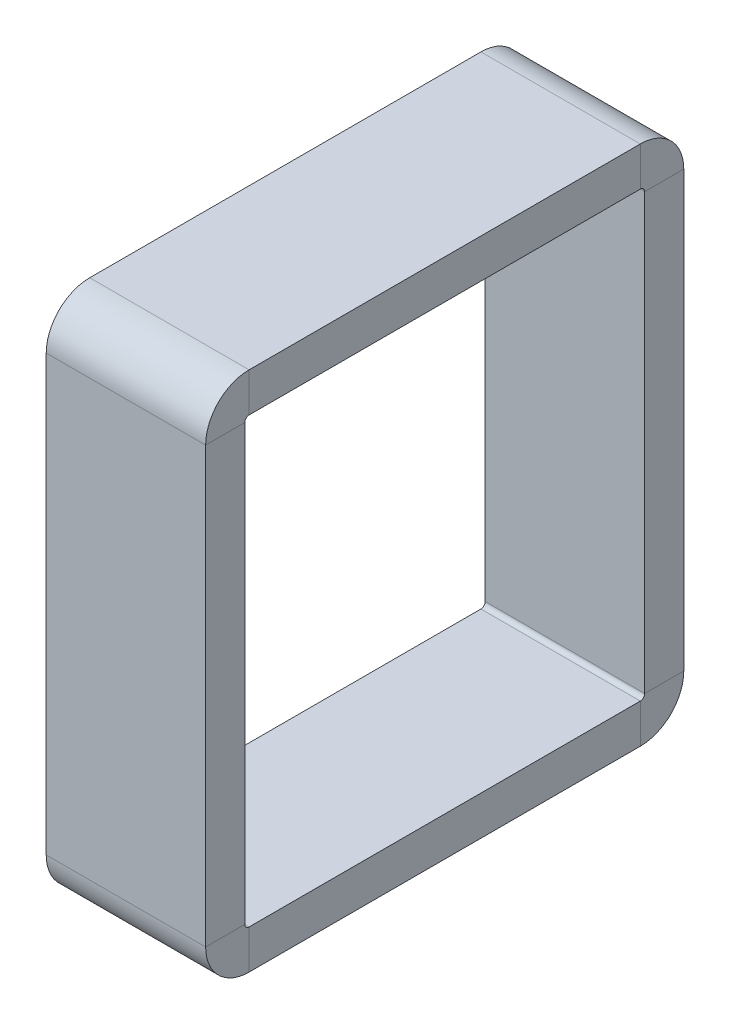
ISO-10303-21;
HEADER;
FILE_DESCRIPTION(('STEP AP214'),'2;1');
FILE_NAME('part.step','',(''),(''),'','','');
FILE_SCHEMA(('AUTOMOTIVE_DESIGN { 1 0 10303 214 1 1 1 1 }'));
ENDSEC;
DATA;
#1=APPLICATION_CONTEXT('core data for automotive mechanical design processes');
#2=APPLICATION_PROTOCOL_DEFINITION('international standard','automotive_design',2000,#1);
#3=PRODUCT_CONTEXT('',#1,'mechanical');
#4=PRODUCT('Part','Part','',(#3));
#5=PRODUCT_RELATED_PRODUCT_CATEGORY('part','',(#4));
#6=PRODUCT_DEFINITION_FORMATION('','',#4);
#7=PRODUCT_DEFINITION_CONTEXT('part definition',#1,'design');
#8=PRODUCT_DEFINITION('design','',#6,#7);
#9=PRODUCT_DEFINITION_SHAPE('','',#8);
#10=(LENGTH_UNIT() NAMED_UNIT(*) SI_UNIT(.MILLI.,.METRE.));
#11=(NAMED_UNIT(*) PLANE_ANGLE_UNIT() SI_UNIT($,.RADIAN.));
#12=(NAMED_UNIT(*) SI_UNIT($,.STERADIAN.) SOLID_ANGLE_UNIT());
#13=UNCERTAINTY_MEASURE_WITH_UNIT(LENGTH_MEASURE(1.E-05),#10,'distance_accuracy_value','');
#14=(GEOMETRIC_REPRESENTATION_CONTEXT(3) GLOBAL_UNCERTAINTY_ASSIGNED_CONTEXT((#13)) GLOBAL_UNIT_ASSIGNED_CONTEXT((#10,
#11,#12)) REPRESENTATION_CONTEXT('',''));
#15=CARTESIAN_POINT('',(0.,0.,0.));
#16=DIRECTION('',(0.,0.,1.));
#17=DIRECTION('',(1.,0.,0.));
#18=AXIS2_PLACEMENT_3D('',#15,#16,#17);
#19=CARTESIAN_POINT('',(3.71677795736341,0.754999569129981,-3.24612158699926));
#20=DIRECTION('',(-1.,1.74845553146952E-07,0.));
#21=DIRECTION('',(0.,-8.74227765734758E-08,-1.));
#22=AXIS2_PLACEMENT_3D('',#19,#20,#21);
#23=PLANE('',#22);
#24=CARTESIAN_POINT('',(3.71677795648918,0.749999568692863,-3.25112158656215));
#25=DIRECTION('',(0.999999999999985,-1.74845553146949E-07,0.));
#26=DIRECTION('',(-1.74845553146949E-07,-0.999999999999981,8.74190497768619E-08));
#27=AXIS2_PLACEMENT_3D('',#24,#25,#26);
#28=CIRCLE('',#27,0.00999999999999571);
#29=CARTESIAN_POINT('',(3.71677795474073,0.739999568692867,-3.25112158568792));
#30=VERTEX_POINT('',#29);
#31=CARTESIAN_POINT('',(3.71677795648918,0.749999567819639,-3.26112158656215));
#32=VERTEX_POINT('',#31);
#33=EDGE_CURVE('E11',#30,#32,#28,.T.);
#34=ORIENTED_EDGE('',*,*,#33,.F.);
#35=DIRECTION('',(1.74845555319994E-07,0.999999999999981,-8.74227801271592E-08));
#36=VECTOR('',#35,1.);
#37=CARTESIAN_POINT('',(3.71677793900463,0.649999568693867,-3.25112157782087));
#38=LINE('',#37,#36);
#39=CARTESIAN_POINT('',(3.71677793900463,0.649999568693867,-3.25112157781987));
#40=VERTEX_POINT('',#39);
#41=EDGE_CURVE('E295',#40,#30,#38,.T.);
#42=ORIENTED_EDGE('',*,*,#41,.F.);
#43=CARTESIAN_POINT('',(3.71677795648918,0.749999568693535,-3.25112158656248));
#44=DIRECTION('',(-0.999999999999985,1.74845553146949E-07,0.));
#45=DIRECTION('',(0.,-8.74290018163109E-08,-0.999999999999996));
#46=AXIS2_PLACEMENT_3D('',#43,#44,#45);
#47=CIRCLE('',#46,0.0999999999996649);
#48=CARTESIAN_POINT('',(3.71677795648918,0.749999559951589,-3.35112158656215));
#49=VERTEX_POINT('',#48);
#50=EDGE_CURVE('E292',#49,#40,#47,.T.);
#51=ORIENTED_EDGE('',*,*,#50,.F.);
#52=DIRECTION('',(0.,-8.74227825933516E-08,-0.999999999999996));
#53=VECTOR('',#52,1.);
#54=CARTESIAN_POINT('',(3.71677795648918,0.749999567818639,-3.26112158656215));
#55=LINE('',#54,#53);
#56=EDGE_CURVE('E281',#32,#49,#55,.T.);
#57=ORIENTED_EDGE('',*,*,#56,.F.);
#58=EDGE_LOOP('',(#34,#42,#51,#57));
#59=FACE_BOUND('',#58,.T.);
#60=ADVANCED_FACE('F17',(#59),#23,.F.);
#61=CARTESIAN_POINT('',(3.35000013200841,0.754999633259452,-3.24612158699926));
#62=DIRECTION('',(-1.,1.74845553146952E-07,0.));
#63=DIRECTION('',(0.,-8.74227765734758E-08,-1.));
#64=AXIS2_PLACEMENT_3D('',#61,#62,#63);
#65=PLANE('',#64);
#66=DIRECTION('',(0.,-8.74227764254459E-08,-0.999999999999996));
#67=VECTOR('',#66,1.);
#68=CARTESIAN_POINT('',(3.35000013113418,0.749999631948111,-3.26112158656215));
#69=LINE('',#68,#67);
#70=CARTESIAN_POINT('',(3.35000013113418,0.749999631949111,-3.26112158656215));
#71=VERTEX_POINT('',#70);
#72=CARTESIAN_POINT('',(3.35000013113418,0.749999624081061,-3.35112158656215));
#73=VERTEX_POINT('',#72);
#74=EDGE_CURVE('E24',#71,#73,#69,.T.);
#75=ORIENTED_EDGE('',*,*,#74,.T.);
#76=CARTESIAN_POINT('',(3.35000013113418,0.749999632823002,-3.25112158656249));
#77=DIRECTION('',(-0.999999999999985,1.74845553146949E-07,0.));
#78=DIRECTION('',(0.,-8.7429410378384E-08,-0.999999999999996));
#79=AXIS2_PLACEMENT_3D('',#76,#77,#78);
#80=CIRCLE('',#79,0.0999999999996649);
#81=CARTESIAN_POINT('',(3.35000011364963,0.649999632822338,-3.25112157781987));
#82=VERTEX_POINT('',#81);
#83=EDGE_CURVE('E290',#73,#82,#80,.T.);
#84=ORIENTED_EDGE('',*,*,#83,.T.);
#85=DIRECTION('',(-1.74845555319994E-07,-0.999999999999981,8.74227801271592E-08));
#86=VECTOR('',#85,1.);
#87=CARTESIAN_POINT('',(3.35000012938573,0.739999632822338,-3.25112158568892));
#88=LINE('',#87,#86);
#89=CARTESIAN_POINT('',(3.35000012938573,0.739999632822338,-3.25112158568792));
#90=VERTEX_POINT('',#89);
#91=EDGE_CURVE('E284',#90,#82,#88,.T.);
#92=ORIENTED_EDGE('',*,*,#91,.F.);
#93=CARTESIAN_POINT('',(3.35000013113418,0.749999632822289,-3.2511215865622));
#94=DIRECTION('',(0.999999999999985,-1.74845553146949E-07,0.));
#95=DIRECTION('',(-1.74845553146949E-07,-0.999999999999981,8.7427665107533E-08));
#96=AXIS2_PLACEMENT_3D('',#93,#94,#95);
#97=CIRCLE('',#96,0.00999999999999571);
#98=EDGE_CURVE('E274',#90,#71,#97,.T.);
#99=ORIENTED_EDGE('',*,*,#98,.T.);
#100=EDGE_LOOP('',(#75,#84,#92,#99));
#101=FACE_BOUND('',#100,.T.);
#102=ADVANCED_FACE('F409',(#101),#65,.T.);
#103=CARTESIAN_POINT('',(3.71677795648918,0.749999568693535,-3.25112158656248));
#104=DIRECTION('',(-1.,1.74845540855596E-07,0.));
#105=DIRECTION('',(-1.74845540855597E-07,-1.,8.74227765734759E-08));
#106=AXIS2_PLACEMENT_3D('',#103,#104,#105);
#107=CYLINDRICAL_SURFACE('',#106,0.0999999999996679);
#108=ORIENTED_EDGE('',*,*,#50,.T.);
#109=DIRECTION('',(0.999999999999985,-1.74845553083486E-07,0.));
#110=VECTOR('',#109,1.);
#111=CARTESIAN_POINT('',(3.35000011364963,0.649999632823338,-3.25112157782087));
#112=LINE('',#111,#110);
#113=EDGE_CURVE('E287',#82,#40,#112,.T.);
#114=ORIENTED_EDGE('',*,*,#113,.F.);
#115=ORIENTED_EDGE('',*,*,#83,.F.);
#116=DIRECTION('',(-0.999999999999985,1.74845553083486E-07,0.));
#117=VECTOR('',#116,1.);
#118=CARTESIAN_POINT('',(3.71677795648918,0.749999559950589,-3.35112158656215));
#119=LINE('',#118,#117);
#120=EDGE_CURVE('E268',#49,#73,#119,.T.);
#121=ORIENTED_EDGE('',*,*,#120,.F.);
#122=EDGE_LOOP('',(#108,#114,#115,#121));
#123=FACE_BOUND('',#122,.T.);
#124=ADVANCED_FACE('F345',(#123),#107,.T.);
#125=CARTESIAN_POINT('',(3.71677795648918,0.749999568692863,-3.25112158656215));
#126=DIRECTION('',(1.,-1.74845430233397E-07,1.30556275034351E-13));
#127=DIRECTION('',(-1.74845430233408E-07,-1.,8.74227765734759E-08));
#128=AXIS2_PLACEMENT_3D('',#125,#126,#127);
#129=CYLINDRICAL_SURFACE('',#128,0.00999999999999601);
#130=ORIENTED_EDGE('',*,*,#33,.T.);
#131=DIRECTION('',(-0.999999999999985,1.74844189739206E-07,0.));
#132=VECTOR('',#131,1.);
#133=CARTESIAN_POINT('',(3.71677795648918,0.749999567818889,-3.26112158656215));
#134=LINE('',#133,#132);
#135=EDGE_CURVE('E276',#32,#71,#134,.T.);
#136=ORIENTED_EDGE('',*,*,#135,.T.);
#137=ORIENTED_EDGE('',*,*,#98,.F.);
#138=DIRECTION('',(-0.999999999999985,1.74845553083486E-07,0.));
#139=VECTOR('',#138,1.);
#140=CARTESIAN_POINT('',(3.71677795474073,0.739999568692867,-3.25112158568892));
#141=LINE('',#140,#139);
#142=EDGE_CURVE('E262',#30,#90,#141,.T.);
#143=ORIENTED_EDGE('',*,*,#142,.F.);
#144=EDGE_LOOP('',(#130,#136,#137,#143));
#145=FACE_BOUND('',#144,.T.);
#146=ADVANCED_FACE('F304',(#145),#129,.F.);
#147=CARTESIAN_POINT('',(3.71677793900464,0.649999647374366,-2.35112157782087));
#148=DIRECTION('',(-1.,1.74845553146952E-07,0.));
#149=DIRECTION('',(1.74845553146952E-07,1.,-8.74227765734759E-08));
#150=AXIS2_PLACEMENT_3D('',#147,#148,#149);
#151=PLANE('',#150);
#152=DIRECTION('',(0.,-8.7422776548804E-08,-0.999999999999996));
#153=VECTOR('',#152,1.);
#154=CARTESIAN_POINT('',(3.71677793900464,0.649999647374366,-2.35112157782087));
#155=LINE('',#154,#153);
#156=CARTESIAN_POINT('',(3.71677793900364,0.649999647377366,-2.35112157781787));
#157=VERTEX_POINT('',#156);
#158=EDGE_CURVE('E278',#157,#40,#155,.T.);
#159=ORIENTED_EDGE('',*,*,#158,.T.);
#160=ORIENTED_EDGE('',*,*,#41,.T.);
#161=DIRECTION('',(0.,-8.74227765488039E-08,-0.999999999999996));
#162=VECTOR('',#161,1.);
#163=CARTESIAN_POINT('',(3.71677795474074,0.739999647373366,-2.35112158568892));
#164=LINE('',#163,#162);
#165=CARTESIAN_POINT('',(3.71677795473974,0.739999647376365,-2.35112158568592));
#166=VERTEX_POINT('',#165);
#167=EDGE_CURVE('E265',#166,#30,#164,.T.);
#168=ORIENTED_EDGE('',*,*,#167,.F.);
#169=DIRECTION('',(1.74845550387524E-07,0.999999999999981,-8.74121663959712E-08));
#170=VECTOR('',#169,1.);
#171=CARTESIAN_POINT('',(3.71677793900364,0.649999647375321,-2.35112157782182));
#172=LINE('',#171,#170);
#173=EDGE_CURVE('E147',#157,#166,#172,.T.);
#174=ORIENTED_EDGE('',*,*,#173,.F.);
#175=EDGE_LOOP('',(#159,#160,#168,#174));
#176=FACE_BOUND('',#175,.T.);
#177=ADVANCED_FACE('F297',(#176),#151,.F.);
#178=CARTESIAN_POINT('',(3.35000011364964,0.649999711503837,-2.35112157782087));
#179=DIRECTION('',(1.74845553146952E-07,1.,-8.74227765734759E-08));
#180=DIRECTION('',(1.,-1.74845553146952E-07,0.));
#181=AXIS2_PLACEMENT_3D('',#178,#179,#180);
#182=PLANE('',#181);
#183=DIRECTION('',(0.,-8.7422776548804E-08,-0.999999999999996));
#184=VECTOR('',#183,1.);
#185=CARTESIAN_POINT('',(3.35000011364964,0.649999711503837,-2.35112157782087));
#186=LINE('',#185,#184);
#187=CARTESIAN_POINT('',(3.35000011365064,0.649999711506837,-2.35112157781787));
#188=VERTEX_POINT('',#187);
#189=EDGE_CURVE('E271',#188,#82,#186,.T.);
#190=ORIENTED_EDGE('',*,*,#189,.T.);
#191=ORIENTED_EDGE('',*,*,#113,.T.);
#192=ORIENTED_EDGE('',*,*,#158,.F.);
#193=DIRECTION('',(0.999999999999985,-1.74845553083486E-07,0.));
#194=VECTOR('',#193,1.);
#195=CARTESIAN_POINT('',(3.35000011364964,0.649999711503837,-2.35112157782087));
#196=LINE('',#195,#194);
#197=EDGE_CURVE('E255',#188,#157,#196,.T.);
#198=ORIENTED_EDGE('',*,*,#197,.F.);
#199=EDGE_LOOP('',(#190,#191,#192,#198));
#200=FACE_BOUND('',#199,.T.);
#201=ADVANCED_FACE('F342',(#200),#182,.F.);
#202=CARTESIAN_POINT('',(3.71677795474074,0.739999647373366,-2.35112158568892));
#203=DIRECTION('',(-1.74845553146952E-07,-1.,8.74227765734759E-08));
#204=DIRECTION('',(-1.,1.74845553146952E-07,0.));
#205=AXIS2_PLACEMENT_3D('',#202,#203,#204);
#206=PLANE('',#205);
#207=ORIENTED_EDGE('',*,*,#167,.T.);
#208=ORIENTED_EDGE('',*,*,#142,.T.);
#209=DIRECTION('',(0.,-8.74227765488039E-08,-0.999999999999996));
#210=VECTOR('',#209,1.);
#211=CARTESIAN_POINT('',(3.35000012938574,0.739999711502837,-2.35112158568892));
#212=LINE('',#211,#210);
#213=CARTESIAN_POINT('',(3.35000012938674,0.739999711505837,-2.35112158568592));
#214=VERTEX_POINT('',#213);
#215=EDGE_CURVE('E259',#214,#90,#212,.T.);
#216=ORIENTED_EDGE('',*,*,#215,.F.);
#217=DIRECTION('',(-0.999999999999985,1.74845553083486E-07,0.));
#218=VECTOR('',#217,1.);
#219=CARTESIAN_POINT('',(3.71677795474074,0.739999647373366,-2.35112158568892));
#220=LINE('',#219,#218);
#221=EDGE_CURVE('E251',#166,#214,#220,.T.);
#222=ORIENTED_EDGE('',*,*,#221,.F.);
#223=EDGE_LOOP('',(#207,#208,#216,#222));
#224=FACE_BOUND('',#223,.T.);
#225=ADVANCED_FACE('F301',(#224),#206,.F.);
#226=CARTESIAN_POINT('',(3.35000012938574,0.739999711502837,-2.35112158568892));
#227=DIRECTION('',(1.,-1.74845553146952E-07,0.));
#228=DIRECTION('',(-1.74845553146952E-07,-1.,8.74227765734759E-08));
#229=AXIS2_PLACEMENT_3D('',#226,#227,#228);
#230=PLANE('',#229);
#231=ORIENTED_EDGE('',*,*,#215,.T.);
#232=ORIENTED_EDGE('',*,*,#91,.T.);
#233=ORIENTED_EDGE('',*,*,#189,.F.);
#234=DIRECTION('',(-1.7484555038515E-07,-0.999999999999981,8.74231995444866E-08));
#235=VECTOR('',#234,1.);
#236=CARTESIAN_POINT('',(3.35000012938674,0.739999711503105,-2.35112158568896));
#237=LINE('',#236,#235);
#238=EDGE_CURVE('E242',#214,#188,#237,.T.);
#239=ORIENTED_EDGE('',*,*,#238,.F.);
#240=EDGE_LOOP('',(#231,#232,#233,#239));
#241=FACE_BOUND('',#240,.T.);
#242=ADVANCED_FACE('F308',(#241),#230,.F.);
#243=CARTESIAN_POINT('',(3.71677814007701,1.79999955557945,-3.40112167835706));
#244=DIRECTION('',(1.,-1.74845553146952E-07,0.));
#245=DIRECTION('',(0.,8.74227765734759E-08,1.));
#246=AXIS2_PLACEMENT_3D('',#243,#244,#245);
#247=PLANE('',#246);
#248=ORIENTED_EDGE('',*,*,#56,.T.);
#249=DIRECTION('',(1.74845553146948E-07,0.999999999999981,-8.74247767512754E-08));
#250=VECTOR('',#249,1.);
#251=CARTESIAN_POINT('',(3.71677795648918,0.749999559950589,-3.35112158656215));
#252=LINE('',#251,#250);
#253=CARTESIAN_POINT('',(3.71677813133474,1.74999955994959,-3.35112167398592));
#254=VERTEX_POINT('',#253);
#255=EDGE_CURVE('E253',#49,#254,#252,.T.);
#256=ORIENTED_EDGE('',*,*,#255,.T.);
#257=DIRECTION('',(0.,8.74338872897881E-08,0.999999999999996));
#258=VECTOR('',#257,1.);
#259=CARTESIAN_POINT('',(3.71677813133474,1.74999955995059,-3.35112167398692));
#260=LINE('',#259,#258);
#261=CARTESIAN_POINT('',(3.71677813133374,1.74999956781864,-3.26112167398592));
#262=VERTEX_POINT('',#261);
#263=EDGE_CURVE('E245',#254,#262,#260,.T.);
#264=ORIENTED_EDGE('',*,*,#263,.T.);
#265=DIRECTION('',(-1.74845553146774E-07,-0.999999999999981,8.74237762181981E-08));
#266=VECTOR('',#265,1.);
#267=CARTESIAN_POINT('',(3.71677813133474,1.74999956781964,-3.26112167398592));
#268=LINE('',#267,#266);
#269=EDGE_CURVE('E233',#262,#32,#268,.T.);
#270=ORIENTED_EDGE('',*,*,#269,.T.);
#271=EDGE_LOOP('',(#248,#256,#264,#270));
#272=FACE_BOUND('',#271,.T.);
#273=ADVANCED_FACE('F350',(#272),#247,.T.);
#274=CARTESIAN_POINT('',(3.71677795648918,0.749999559950589,-3.35112158656215));
#275=DIRECTION('',(0.,8.7424776751277E-08,1.));
#276=DIRECTION('',(1.74845553146952E-07,1.,-8.7424776751277E-08));
#277=AXIS2_PLACEMENT_3D('',#274,#275,#276);
#278=PLANE('',#277);
#279=ORIENTED_EDGE('',*,*,#120,.T.);
#280=DIRECTION('',(1.74845553146948E-07,0.999999999999981,-8.74247767512754E-08));
#281=VECTOR('',#280,1.);
#282=CARTESIAN_POINT('',(3.35000013113418,0.749999624080061,-3.35112158656215));
#283=LINE('',#282,#281);
#284=CARTESIAN_POINT('',(3.35000030598074,1.74999962407906,-3.35112167398593));
#285=VERTEX_POINT('',#284);
#286=EDGE_CURVE('E247',#73,#285,#283,.T.);
#287=ORIENTED_EDGE('',*,*,#286,.T.);
#288=DIRECTION('',(-0.999999999999985,1.74845553083486E-07,0.));
#289=VECTOR('',#288,1.);
#290=CARTESIAN_POINT('',(3.71677813133474,1.74999955995059,-3.35112167398692));
#291=LINE('',#290,#289);
#292=EDGE_CURVE('E236',#254,#285,#291,.T.);
#293=ORIENTED_EDGE('',*,*,#292,.F.);
#294=ORIENTED_EDGE('',*,*,#255,.F.);
#295=EDGE_LOOP('',(#279,#287,#293,#294));
#296=FACE_BOUND('',#295,.T.);
#297=ADVANCED_FACE('F364',(#296),#278,.F.);
#298=CARTESIAN_POINT('',(3.71677813133474,1.74999956781964,-3.26112167398592));
#299=DIRECTION('',(0.,-8.74237762182872E-08,-1.));
#300=DIRECTION('',(-1.74845553146952E-07,-1.,8.74237762182872E-08));
#301=AXIS2_PLACEMENT_3D('',#298,#299,#300);
#302=PLANE('',#301);
#303=DIRECTION('',(-0.999999999999985,1.74844189739206E-07,0.));
#304=VECTOR('',#303,1.);
#305=CARTESIAN_POINT('',(3.71677813133474,1.74999956781939,-3.26112167398592));
#306=LINE('',#305,#304);
#307=CARTESIAN_POINT('',(3.35000030598074,1.74999963194711,-3.26112167398593));
#308=VERTEX_POINT('',#307);
#309=EDGE_CURVE('E249',#262,#308,#306,.T.);
#310=ORIENTED_EDGE('',*,*,#309,.T.);
#311=DIRECTION('',(-1.74845553146861E-07,-0.999999999999981,8.74237762182418E-08));
#312=VECTOR('',#311,1.);
#313=CARTESIAN_POINT('',(3.35000030597974,1.74999963194836,-3.26112167398593));
#314=LINE('',#313,#312);
#315=EDGE_CURVE('E239',#308,#71,#314,.T.);
#316=ORIENTED_EDGE('',*,*,#315,.T.);
#317=ORIENTED_EDGE('',*,*,#135,.F.);
#318=ORIENTED_EDGE('',*,*,#269,.F.);
#319=EDGE_LOOP('',(#310,#316,#317,#318));
#320=FACE_BOUND('',#319,.T.);
#321=ADVANCED_FACE('F355',(#320),#302,.F.);
#322=CARTESIAN_POINT('',(3.35000031472201,1.79999961970892,-3.40112167835707));
#323=DIRECTION('',(1.,-1.74845553146952E-07,0.));
#324=DIRECTION('',(0.,8.74227765734759E-08,1.));
#325=AXIS2_PLACEMENT_3D('',#322,#323,#324);
#326=PLANE('',#325);
#327=ORIENTED_EDGE('',*,*,#315,.F.);
#328=DIRECTION('',(0.,8.74333864567739E-08,0.999999999999996));
#329=VECTOR('',#328,1.);
#330=CARTESIAN_POINT('',(3.35000030597974,1.74999962407911,-3.35112167398597));
#331=LINE('',#330,#329);
#332=EDGE_CURVE('E228',#285,#308,#331,.T.);
#333=ORIENTED_EDGE('',*,*,#332,.F.);
#334=ORIENTED_EDGE('',*,*,#286,.F.);
#335=ORIENTED_EDGE('',*,*,#74,.F.);
#336=EDGE_LOOP('',(#327,#333,#334,#335));
#337=FACE_BOUND('',#336,.T.);
#338=ADVANCED_FACE('F361',(#337),#326,.F.);
#339=CARTESIAN_POINT('',(3.71677814969352,1.85499956912898,-3.24612168316632));
#340=DIRECTION('',(-1.,1.74845553146952E-07,0.));
#341=DIRECTION('',(0.,-8.74227765734759E-08,-1.));
#342=AXIS2_PLACEMENT_3D('',#339,#340,#341);
#343=PLANE('',#342);
#344=CARTESIAN_POINT('',(3.71677813133474,1.74999956869287,-3.25112167398593));
#345=DIRECTION('',(0.999999999999985,-1.74845553146949E-07,0.));
#346=DIRECTION('',(0.,-8.74249561633335E-08,-0.999999999999996));
#347=AXIS2_PLACEMENT_3D('',#344,#345,#346);
#348=CIRCLE('',#347,0.0099999999999977);
#349=CARTESIAN_POINT('',(3.71677813308219,1.75999956869287,-3.25112167486015));
#350=VERTEX_POINT('',#349);
#351=EDGE_CURVE('E231',#262,#350,#348,.T.);
#352=ORIENTED_EDGE('',*,*,#351,.F.);
#353=ORIENTED_EDGE('',*,*,#263,.F.);
#354=CARTESIAN_POINT('',(3.71677813133474,1.74999956869307,-3.25112167398713));
#355=DIRECTION('',(-0.999999999999985,1.74845553146949E-07,0.));
#356=DIRECTION('',(1.74845553146949E-07,0.999999999999981,-8.74205197131637E-08));
#357=AXIS2_PLACEMENT_3D('',#354,#355,#356);
#358=CIRCLE('',#357,0.099999999998794);
#359=CARTESIAN_POINT('',(3.71677814881829,1.84999956869187,-3.2511216827282));
#360=VERTEX_POINT('',#359);
#361=EDGE_CURVE('E225',#360,#254,#358,.T.);
#362=ORIENTED_EDGE('',*,*,#361,.F.);
#363=DIRECTION('',(1.74845555319994E-07,0.999999999999981,-8.74338823574056E-08));
#364=VECTOR('',#363,1.);
#365=CARTESIAN_POINT('',(3.71677813308319,1.75999956869287,-3.25112167486015));
#366=LINE('',#365,#364);
#367=EDGE_CURVE('E215',#350,#360,#366,.T.);
#368=ORIENTED_EDGE('',*,*,#367,.F.);
#369=EDGE_LOOP('',(#352,#353,#362,#368));
#370=FACE_BOUND('',#369,.T.);
#371=ADVANCED_FACE('F372',(#370),#343,.F.);
#372=CARTESIAN_POINT('',(3.71677813133474,1.74999956869307,-3.25112167398713));
#373=DIRECTION('',(-1.,1.74845565438305E-07,0.));
#374=DIRECTION('',(-1.74845565438306E-07,-1.,8.74227765734759E-08));
#375=AXIS2_PLACEMENT_3D('',#372,#373,#374);
#376=CYLINDRICAL_SURFACE('',#375,0.0999999999987971);
#377=ORIENTED_EDGE('',*,*,#361,.T.);
#378=ORIENTED_EDGE('',*,*,#292,.T.);
#379=CARTESIAN_POINT('',(3.35000030597974,1.74999963282255,-3.25112167398713));
#380=DIRECTION('',(-0.999999999999985,1.74845553146949E-07,0.));
#381=DIRECTION('',(1.74845553146949E-07,0.999999999999981,-8.74204753042427E-08));
#382=AXIS2_PLACEMENT_3D('',#379,#380,#381);
#383=CIRCLE('',#382,0.099999999998794);
#384=CARTESIAN_POINT('',(3.35000032346529,1.84999963282134,-3.25112168272821));
#385=VERTEX_POINT('',#384);
#386=EDGE_CURVE('E218',#385,#285,#383,.T.);
#387=ORIENTED_EDGE('',*,*,#386,.F.);
#388=DIRECTION('',(-0.999999999999985,1.74845553083486E-07,0.));
#389=VECTOR('',#388,1.);
#390=CARTESIAN_POINT('',(3.71677814881929,1.84999956869187,-3.2511216827292));
#391=LINE('',#390,#389);
#392=EDGE_CURVE('E209',#360,#385,#391,.T.);
#393=ORIENTED_EDGE('',*,*,#392,.F.);
#394=EDGE_LOOP('',(#377,#378,#387,#393));
#395=FACE_BOUND('',#394,.T.);
#396=ADVANCED_FACE('F368',(#395),#376,.T.);
#397=CARTESIAN_POINT('',(3.71677813133474,1.74999956869287,-3.25112167398593));
#398=DIRECTION('',(1.,-1.74845676060485E-07,1.30556296525248E-13));
#399=DIRECTION('',(-1.74845676060496E-07,-1.,8.74227765734759E-08));
#400=AXIS2_PLACEMENT_3D('',#397,#398,#399);
#401=CYLINDRICAL_SURFACE('',#400,0.00999999999999801);
#402=ORIENTED_EDGE('',*,*,#351,.T.);
#403=DIRECTION('',(-0.999999999999985,1.74842826394926E-07,0.));
#404=VECTOR('',#403,1.);
#405=CARTESIAN_POINT('',(3.71677813308319,1.75999956869287,-3.25112167486015));
#406=LINE('',#405,#404);
#407=CARTESIAN_POINT('',(3.35000030772919,1.75999963282134,-3.25112167486015));
#408=VERTEX_POINT('',#407);
#409=EDGE_CURVE('E221',#350,#408,#406,.T.);
#410=ORIENTED_EDGE('',*,*,#409,.T.);
#411=CARTESIAN_POINT('',(3.35000030597974,1.74999963282239,-3.25112167398597));
#412=DIRECTION('',(0.999999999999985,-1.74845553146949E-07,0.));
#413=DIRECTION('',(0.,-8.75294725588718E-08,-0.999999999999996));
#414=AXIS2_PLACEMENT_3D('',#411,#412,#413);
#415=CIRCLE('',#414,0.0099999999999977);
#416=EDGE_CURVE('E212',#308,#408,#415,.T.);
#417=ORIENTED_EDGE('',*,*,#416,.F.);
#418=ORIENTED_EDGE('',*,*,#309,.F.);
#419=EDGE_LOOP('',(#402,#410,#417,#418));
#420=FACE_BOUND('',#419,.T.);
#421=ADVANCED_FACE('F374',(#420),#401,.F.);
#422=CARTESIAN_POINT('',(3.35000032433852,1.85499963325845,-3.24612168316632));
#423=DIRECTION('',(-1.,1.74845553146952E-07,0.));
#424=DIRECTION('',(0.,-8.74227765734759E-08,-1.));
#425=AXIS2_PLACEMENT_3D('',#422,#423,#424);
#426=PLANE('',#425);
#427=DIRECTION('',(1.74845550383717E-07,0.999999999999981,-8.74348938929626E-08));
#428=VECTOR('',#427,1.);
#429=CARTESIAN_POINT('',(3.35000030772819,1.75999963282133,-3.25112167486006));
#430=LINE('',#429,#428);
#431=EDGE_CURVE('E223',#408,#385,#430,.T.);
#432=ORIENTED_EDGE('',*,*,#431,.T.);
#433=ORIENTED_EDGE('',*,*,#386,.T.);
#434=ORIENTED_EDGE('',*,*,#332,.T.);
#435=ORIENTED_EDGE('',*,*,#416,.T.);
#436=EDGE_LOOP('',(#432,#433,#434,#435));
#437=FACE_BOUND('',#436,.T.);
#438=ADVANCED_FACE('F377',(#437),#426,.T.);
#439=CARTESIAN_POINT('',(3.71677815668734,1.89499956476084,-3.29612168666323));
#440=DIRECTION('',(1.,-1.74845553146952E-07,0.));
#441=DIRECTION('',(0.,8.74227765734759E-08,1.));
#442=AXIS2_PLACEMENT_3D('',#439,#440,#441);
#443=PLANE('',#442);
#444=ORIENTED_EDGE('',*,*,#367,.T.);
#445=DIRECTION('',(0.,8.74261100551144E-08,0.999999999999996));
#446=VECTOR('',#445,1.);
#447=CARTESIAN_POINT('',(3.71677814881929,1.84999956869187,-3.2511216827292));
#448=LINE('',#447,#446);
#449=CARTESIAN_POINT('',(3.7167781488183,1.84999964737537,-2.3511216827302));
#450=VERTEX_POINT('',#449);
#451=EDGE_CURVE('E207',#360,#450,#448,.T.);
#452=ORIENTED_EDGE('',*,*,#451,.T.);
#453=DIRECTION('',(-1.74845555318051E-07,-0.999999999999981,8.74227653232141E-08));
#454=VECTOR('',#453,1.);
#455=CARTESIAN_POINT('',(3.7167781488193,1.84999964737537,-2.3511216827292));
#456=LINE('',#455,#454);
#457=CARTESIAN_POINT('',(3.7167781330822,1.75999964737537,-2.35112167486115));
#458=VERTEX_POINT('',#457);
#459=EDGE_CURVE('E201',#450,#458,#456,.T.);
#460=ORIENTED_EDGE('',*,*,#459,.T.);
#461=DIRECTION('',(0.,-8.74249985986058E-08,-0.999999999999996));
#462=VECTOR('',#461,1.);
#463=CARTESIAN_POINT('',(3.7167781330832,1.75999964737537,-2.35112167486115));
#464=LINE('',#463,#462);
#465=EDGE_CURVE('E192',#458,#350,#464,.T.);
#466=ORIENTED_EDGE('',*,*,#465,.T.);
#467=EDGE_LOOP('',(#444,#452,#460,#466));
#468=FACE_BOUND('',#467,.T.);
#469=ADVANCED_FACE('F397',(#468),#443,.T.);
#470=CARTESIAN_POINT('',(3.71677814881929,1.84999956869187,-3.2511216827292));
#471=DIRECTION('',(-1.74845553146952E-07,-1.,8.74261099564282E-08));
#472=DIRECTION('',(0.,8.74261099564282E-08,1.));
#473=AXIS2_PLACEMENT_3D('',#470,#471,#472);
#474=PLANE('',#473);
#475=ORIENTED_EDGE('',*,*,#392,.T.);
#476=DIRECTION('',(0.,8.74261100551145E-08,0.999999999999996));
#477=VECTOR('',#476,1.);
#478=CARTESIAN_POINT('',(3.35000032346429,1.84999963282134,-3.2511216827292));
#479=LINE('',#478,#477);
#480=CARTESIAN_POINT('',(3.3500003234653,1.84999971150484,-2.3511216827302));
#481=VERTEX_POINT('',#480);
#482=EDGE_CURVE('E203',#385,#481,#479,.T.);
#483=ORIENTED_EDGE('',*,*,#482,.T.);
#484=DIRECTION('',(-0.999999999999985,1.74845553083487E-07,0.));
#485=VECTOR('',#484,1.);
#486=CARTESIAN_POINT('',(3.7167781488193,1.84999964737537,-2.3511216827292));
#487=LINE('',#486,#485);
#488=EDGE_CURVE('E195',#450,#481,#487,.T.);
#489=ORIENTED_EDGE('',*,*,#488,.F.);
#490=ORIENTED_EDGE('',*,*,#451,.F.);
#491=EDGE_LOOP('',(#475,#483,#489,#490));
#492=FACE_BOUND('',#491,.T.);
#493=ADVANCED_FACE('F381',(#492),#474,.F.);
#494=CARTESIAN_POINT('',(3.7167781330832,1.75999964737537,-2.35112167486115));
#495=DIRECTION('',(1.74842826458391E-07,1.,-8.74249987465387E-08));
#496=DIRECTION('',(0.,-8.74249987465387E-08,-1.));
#497=AXIS2_PLACEMENT_3D('',#494,#495,#496);
#498=PLANE('',#497);
#499=DIRECTION('',(-0.999999999999985,1.74842826394926E-07,0.));
#500=VECTOR('',#499,1.);
#501=CARTESIAN_POINT('',(3.7167781330832,1.75999964737537,-2.35112167486115));
#502=LINE('',#501,#500);
#503=CARTESIAN_POINT('',(3.3500003077292,1.75999971150484,-2.35112167486116));
#504=VERTEX_POINT('',#503);
#505=EDGE_CURVE('E205',#458,#504,#502,.T.);
#506=ORIENTED_EDGE('',*,*,#505,.T.);
#507=DIRECTION('',(0.,-8.7424998845322E-08,-0.999999999999996));
#508=VECTOR('',#507,1.);
#509=CARTESIAN_POINT('',(3.3500003077282,1.75999971150384,-2.35112167486115));
#510=LINE('',#509,#508);
#511=EDGE_CURVE('E198',#504,#408,#510,.T.);
#512=ORIENTED_EDGE('',*,*,#511,.T.);
#513=ORIENTED_EDGE('',*,*,#409,.F.);
#514=ORIENTED_EDGE('',*,*,#465,.F.);
#515=EDGE_LOOP('',(#506,#512,#513,#514));
#516=FACE_BOUND('',#515,.T.);
#517=ADVANCED_FACE('F398',(#516),#498,.F.);
#518=CARTESIAN_POINT('',(3.35000033133234,1.89499962889031,-3.29612168666323));
#519=DIRECTION('',(1.,-1.74845553146952E-07,0.));
#520=DIRECTION('',(0.,8.74227765734759E-08,1.));
#521=AXIS2_PLACEMENT_3D('',#518,#519,#520);
#522=PLANE('',#521);
#523=ORIENTED_EDGE('',*,*,#511,.F.);
#524=DIRECTION('',(-1.74845550383726E-07,-0.999999999999981,8.74227751918632E-08));
#525=VECTOR('',#524,1.);
#526=CARTESIAN_POINT('',(3.3500003234653,1.84999971150484,-2.35112168272921));
#527=LINE('',#526,#525);
#528=EDGE_CURVE('E187',#481,#504,#527,.T.);
#529=ORIENTED_EDGE('',*,*,#528,.F.);
#530=ORIENTED_EDGE('',*,*,#482,.F.);
#531=ORIENTED_EDGE('',*,*,#431,.F.);
#532=EDGE_LOOP('',(#523,#529,#530,#531));
#533=FACE_BOUND('',#532,.T.);
#534=ADVANCED_FACE('F385',(#533),#522,.F.);
#535=CARTESIAN_POINT('',(3.71677814969253,1.85499965655476,-2.24612168316732));
#536=DIRECTION('',(-1.,1.74845553146952E-07,0.));
#537=DIRECTION('',(0.,-8.74227765734759E-08,-1.));
#538=AXIS2_PLACEMENT_3D('',#535,#536,#537);
#539=PLANE('',#538);
#540=CARTESIAN_POINT('',(3.71677813133374,1.74999964737537,-2.35112167398692));
#541=DIRECTION('',(0.999999999999985,-1.74845553146949E-07,0.));
#542=DIRECTION('',(1.74845553146949E-07,0.999999999999981,-8.74229577618776E-08));
#543=AXIS2_PLACEMENT_3D('',#540,#541,#542);
#544=CIRCLE('',#543,0.00999999999999926);
#545=CARTESIAN_POINT('',(3.71677813133374,1.74999964824859,-2.34112167398692));
#546=VERTEX_POINT('',#545);
#547=EDGE_CURVE('E190',#458,#546,#544,.T.);
#548=ORIENTED_EDGE('',*,*,#547,.F.);
#549=ORIENTED_EDGE('',*,*,#459,.F.);
#550=CARTESIAN_POINT('',(3.71677813133374,1.74999964737539,-2.3511216739879));
#551=DIRECTION('',(-0.999999999999985,1.74845553146949E-07,0.));
#552=DIRECTION('',(0.,8.74225314362543E-08,0.999999999999996));
#553=AXIS2_PLACEMENT_3D('',#550,#551,#552);
#554=CIRCLE('',#553,0.0999999999999726);
#555=CARTESIAN_POINT('',(3.71677813133374,1.74999965611764,-2.25112167398792));
#556=VERTEX_POINT('',#555);
#557=EDGE_CURVE('E184',#556,#450,#554,.T.);
#558=ORIENTED_EDGE('',*,*,#557,.F.);
#559=DIRECTION('',(0.,8.74343930599545E-08,0.999999999999996));
#560=VECTOR('',#559,1.);
#561=CARTESIAN_POINT('',(3.71677813133374,1.74999964824955,-2.34112167398697));
#562=LINE('',#561,#560);
#563=EDGE_CURVE('E176',#546,#556,#562,.T.);
#564=ORIENTED_EDGE('',*,*,#563,.F.);
#565=EDGE_LOOP('',(#548,#549,#558,#564));
#566=FACE_BOUND('',#565,.T.);
#567=ADVANCED_FACE('F395',(#566),#539,.F.);
#568=CARTESIAN_POINT('',(3.71677813133374,1.74999964737539,-2.3511216739879));
#569=DIRECTION('',(-1.,1.74845565438307E-07,0.));
#570=DIRECTION('',(-1.74845565438306E-07,-1.,8.74227765734759E-08));
#571=AXIS2_PLACEMENT_3D('',#568,#569,#570);
#572=CYLINDRICAL_SURFACE('',#571,0.0999999999999757);
#573=ORIENTED_EDGE('',*,*,#557,.T.);
#574=ORIENTED_EDGE('',*,*,#488,.T.);
#575=CARTESIAN_POINT('',(3.35000030598074,1.74999971150487,-2.3511216739879));
#576=DIRECTION('',(-0.999999999999985,1.74845553146949E-07,0.));
#577=DIRECTION('',(0.,8.74224870273333E-08,0.999999999999996));
#578=AXIS2_PLACEMENT_3D('',#575,#576,#577);
#579=CIRCLE('',#578,0.0999999999999726);
#580=CARTESIAN_POINT('',(3.35000030598074,1.74999972024711,-2.25112167398793));
#581=VERTEX_POINT('',#580);
#582=EDGE_CURVE('E178',#581,#481,#579,.T.);
#583=ORIENTED_EDGE('',*,*,#582,.F.);
#584=DIRECTION('',(-0.999999999999985,1.7484418974016E-07,0.));
#585=VECTOR('',#584,1.);
#586=CARTESIAN_POINT('',(3.71677813133374,1.74999965611839,-2.25112167398792));
#587=LINE('',#586,#585);
#588=EDGE_CURVE('E167',#556,#581,#587,.T.);
#589=ORIENTED_EDGE('',*,*,#588,.F.);
#590=EDGE_LOOP('',(#573,#574,#583,#589));
#591=FACE_BOUND('',#590,.T.);
#592=ADVANCED_FACE('F335',(#591),#572,.T.);
#593=CARTESIAN_POINT('',(3.71677813133374,1.74999964737537,-2.35112167398692));
#594=DIRECTION('',(1.,-1.74845676060506E-07,-1.15270791313041E-13));
#595=DIRECTION('',(-1.74845676060496E-07,-1.,8.74227765734759E-08));
#596=AXIS2_PLACEMENT_3D('',#593,#594,#595);
#597=CYLINDRICAL_SURFACE('',#596,0.00999999999999957);
#598=ORIENTED_EDGE('',*,*,#547,.T.);
#599=DIRECTION('',(-0.999999999999985,1.7484555308444E-07,0.));
#600=VECTOR('',#599,1.);
#601=CARTESIAN_POINT('',(3.71677813133374,1.74999964824959,-2.34112167398692));
#602=LINE('',#601,#600);
#603=CARTESIAN_POINT('',(3.35000030598074,1.74999971237806,-2.34112167398693));
#604=VERTEX_POINT('',#603);
#605=EDGE_CURVE('E158',#546,#604,#602,.T.);
#606=ORIENTED_EDGE('',*,*,#605,.T.);
#607=CARTESIAN_POINT('',(3.35000030598074,1.74999971150488,-2.35112167398688));
#608=DIRECTION('',(0.999999999999985,-1.74845553146949E-07,0.));
#609=DIRECTION('',(1.74845553146949E-07,0.999999999999981,-8.7427443062897E-08));
#610=AXIS2_PLACEMENT_3D('',#607,#608,#609);
#611=CIRCLE('',#610,0.00999999999999926);
#612=EDGE_CURVE('E173',#504,#604,#611,.T.);
#613=ORIENTED_EDGE('',*,*,#612,.F.);
#614=ORIENTED_EDGE('',*,*,#505,.F.);
#615=EDGE_LOOP('',(#598,#606,#613,#614));
#616=FACE_BOUND('',#615,.T.);
#617=ADVANCED_FACE('F389',(#616),#597,.F.);
#618=CARTESIAN_POINT('',(3.35000032433953,1.85499972068423,-2.24612168316732));
#619=DIRECTION('',(-1.,1.74845553146952E-07,0.));
#620=DIRECTION('',(0.,-8.74227765734759E-08,-1.));
#621=AXIS2_PLACEMENT_3D('',#618,#619,#620);
#622=PLANE('',#621);
#623=DIRECTION('',(0.,8.74227727256735E-08,0.999999999999996));
#624=VECTOR('',#623,1.);
#625=CARTESIAN_POINT('',(3.35000030598074,1.74999971237907,-2.34112167398693));
#626=LINE('',#625,#624);
#627=EDGE_CURVE('E182',#604,#581,#626,.T.);
#628=ORIENTED_EDGE('',*,*,#627,.T.);
#629=ORIENTED_EDGE('',*,*,#582,.T.);
#630=ORIENTED_EDGE('',*,*,#528,.T.);
#631=ORIENTED_EDGE('',*,*,#612,.T.);
#632=EDGE_LOOP('',(#628,#629,#630,#631));
#633=FACE_BOUND('',#632,.T.);
#634=ADVANCED_FACE('F331',(#633),#622,.T.);
#635=CARTESIAN_POINT('',(3.71677814007602,1.79999964387945,-2.39112167835806));
#636=DIRECTION('',(1.,-1.74845553146952E-07,0.));
#637=DIRECTION('',(0.,8.74227765734759E-08,1.));
#638=AXIS2_PLACEMENT_3D('',#635,#636,#637);
#639=PLANE('',#638);
#640=ORIENTED_EDGE('',*,*,#563,.T.);
#641=DIRECTION('',(-1.74845553146788E-07,-0.999999999999981,8.74268057947948E-08));
#642=VECTOR('',#641,1.);
#643=CARTESIAN_POINT('',(3.71677813133374,1.74999965611856,-2.25112167398795));
#644=LINE('',#643,#642);
#645=CARTESIAN_POINT('',(3.71677795648819,0.749999656118643,-2.25112158656115));
#646=VERTEX_POINT('',#645);
#647=EDGE_CURVE('E135',#556,#646,#644,.T.);
#648=ORIENTED_EDGE('',*,*,#647,.T.);
#649=DIRECTION('',(0.,-8.74224125202244E-08,-0.999999999999996));
#650=VECTOR('',#649,1.);
#651=CARTESIAN_POINT('',(3.71677795648819,0.74999965611761,-2.2511215865614));
#652=LINE('',#651,#650);
#653=CARTESIAN_POINT('',(3.71677795648819,0.749999648250593,-2.34112158656015));
#654=VERTEX_POINT('',#653);
#655=EDGE_CURVE('E127',#646,#654,#652,.T.);
#656=ORIENTED_EDGE('',*,*,#655,.T.);
#657=DIRECTION('',(1.74845553146948E-07,0.999999999999981,-8.74266858907881E-08));
#658=VECTOR('',#657,1.);
#659=CARTESIAN_POINT('',(3.71677795648819,0.749999648249589,-2.34112158656024));
#660=LINE('',#659,#658);
#661=EDGE_CURVE('E132',#654,#546,#660,.T.);
#662=ORIENTED_EDGE('',*,*,#661,.T.);
#663=EDGE_LOOP('',(#640,#648,#656,#662));
#664=FACE_BOUND('',#663,.T.);
#665=ADVANCED_FACE('F130',(#664),#639,.T.);
#666=CARTESIAN_POINT('',(3.71677813133374,1.74999965611864,-2.25112167398792));
#667=DIRECTION('',(0.,-8.74267769290782E-08,-1.));
#668=DIRECTION('',(-1.74845553146952E-07,-1.,8.74267769290782E-08));
#669=AXIS2_PLACEMENT_3D('',#666,#667,#668);
#670=PLANE('',#669);
#671=ORIENTED_EDGE('',*,*,#588,.T.);
#672=DIRECTION('',(-1.74845553146861E-07,-0.999999999999981,8.74267769290328E-08));
#673=VECTOR('',#672,1.);
#674=CARTESIAN_POINT('',(3.35000030598075,1.74999972024736,-2.25112167398793));
#675=LINE('',#674,#673);
#676=CARTESIAN_POINT('',(3.35000013113519,0.749999720248115,-2.25112158656115));
#677=VERTEX_POINT('',#676);
#678=EDGE_CURVE('E139',#581,#677,#675,.T.);
#679=ORIENTED_EDGE('',*,*,#678,.T.);
#680=DIRECTION('',(-0.999999999999985,1.7484418974016E-07,0.));
#681=VECTOR('',#680,1.);
#682=CARTESIAN_POINT('',(3.71677795648819,0.749999656117893,-2.25112158656115));
#683=LINE('',#682,#681);
#684=EDGE_CURVE('E159',#646,#677,#683,.T.);
#685=ORIENTED_EDGE('',*,*,#684,.F.);
#686=ORIENTED_EDGE('',*,*,#647,.F.);
#687=EDGE_LOOP('',(#671,#679,#685,#686));
#688=FACE_BOUND('',#687,.T.);
#689=ADVANCED_FACE('F338',(#688),#670,.F.);
#690=CARTESIAN_POINT('',(3.71677795648819,0.749999648249593,-2.34112158656015));
#691=DIRECTION('',(0.,8.7426776484989E-08,1.));
#692=DIRECTION('',(1.74845553146952E-07,1.,-8.7426776484989E-08));
#693=AXIS2_PLACEMENT_3D('',#690,#691,#692);
#694=PLANE('',#693);
#695=DIRECTION('',(-0.999999999999985,1.7484555308444E-07,0.));
#696=VECTOR('',#695,1.);
#697=CARTESIAN_POINT('',(3.71677795648819,0.749999648249593,-2.34112158656015));
#698=LINE('',#697,#696);
#699=CARTESIAN_POINT('',(3.35000013113519,0.749999712380065,-2.34112158656015));
#700=VERTEX_POINT('',#699);
#701=EDGE_CURVE('E156',#654,#700,#698,.T.);
#702=ORIENTED_EDGE('',*,*,#701,.T.);
#703=DIRECTION('',(1.74845553146948E-07,0.999999999999981,-8.74267764849873E-08));
#704=VECTOR('',#703,1.);
#705=CARTESIAN_POINT('',(3.35000013113519,0.749999712379065,-2.34112158656015));
#706=LINE('',#705,#704);
#707=EDGE_CURVE('E140',#700,#604,#706,.T.);
#708=ORIENTED_EDGE('',*,*,#707,.T.);
#709=ORIENTED_EDGE('',*,*,#605,.F.);
#710=ORIENTED_EDGE('',*,*,#661,.F.);
#711=EDGE_LOOP('',(#702,#708,#709,#710));
#712=FACE_BOUND('',#711,.T.);
#713=ADVANCED_FACE('F154',(#712),#694,.F.);
#714=CARTESIAN_POINT('',(3.35000031472302,1.79999970800793,-2.39112167835807));
#715=DIRECTION('',(1.,-1.74845553146952E-07,0.));
#716=DIRECTION('',(0.,8.74227765734759E-08,1.));
#717=AXIS2_PLACEMENT_3D('',#714,#715,#716);
#718=PLANE('',#717);
#719=ORIENTED_EDGE('',*,*,#707,.F.);
#720=DIRECTION('',(0.,-8.7423280961147E-08,-0.999999999999996));
#721=VECTOR('',#720,1.);
#722=CARTESIAN_POINT('',(3.35000013113519,0.74999972024716,-2.2511215865612));
#723=LINE('',#722,#721);
#724=EDGE_CURVE('E151',#677,#700,#723,.T.);
#725=ORIENTED_EDGE('',*,*,#724,.F.);
#726=ORIENTED_EDGE('',*,*,#678,.F.);
#727=ORIENTED_EDGE('',*,*,#627,.F.);
#728=EDGE_LOOP('',(#719,#725,#726,#727));
#729=FACE_BOUND('',#728,.T.);
#730=ADVANCED_FACE('F328',(#729),#718,.F.);
#731=CARTESIAN_POINT('',(3.71677795736242,0.754999656555757,-2.24612158699726));
#732=DIRECTION('',(-1.,1.74845553146952E-07,0.));
#733=DIRECTION('',(0.,-8.74227765734759E-08,-1.));
#734=AXIS2_PLACEMENT_3D('',#731,#732,#733);
#735=PLANE('',#734);
#736=CARTESIAN_POINT('',(3.71677795648819,0.749999647376364,-2.35112158656015));
#737=DIRECTION('',(0.999999999999985,-1.74845553146949E-07,0.));
#738=DIRECTION('',(0.,8.74274874718258E-08,0.999999999999996));
#739=AXIS2_PLACEMENT_3D('',#736,#737,#738);
#740=CIRCLE('',#739,0.00999999999999815);
#741=EDGE_CURVE('E144',#654,#166,#740,.T.);
#742=ORIENTED_EDGE('',*,*,#741,.F.);
#743=ORIENTED_EDGE('',*,*,#655,.F.);
#744=CARTESIAN_POINT('',(3.71677795648819,0.749999647375469,-2.35112158655925));
#745=DIRECTION('',(-0.999999999999985,1.74845553146949E-07,0.));
#746=DIRECTION('',(-1.74845553146949E-07,-0.999999999999981,8.74090355668027E-08));
#747=AXIS2_PLACEMENT_3D('',#744,#745,#746);
#748=CIRCLE('',#747,0.0999999999981009);
#749=EDGE_CURVE('E317',#157,#646,#748,.T.);
#750=ORIENTED_EDGE('',*,*,#749,.F.);
#751=ORIENTED_EDGE('',*,*,#173,.T.);
#752=EDGE_LOOP('',(#742,#743,#750,#751));
#753=FACE_BOUND('',#752,.T.);
#754=ADVANCED_FACE('F145',(#753),#735,.F.);
#755=CARTESIAN_POINT('',(3.71677795648819,0.749999647375469,-2.35112158655925));
#756=DIRECTION('',(-1.,1.74845540855598E-07,0.));
#757=DIRECTION('',(-1.74845540855597E-07,-1.,8.74227765734759E-08));
#758=AXIS2_PLACEMENT_3D('',#755,#756,#757);
#759=CYLINDRICAL_SURFACE('',#758,0.0999999999981039);
#760=ORIENTED_EDGE('',*,*,#749,.T.);
#761=ORIENTED_EDGE('',*,*,#684,.T.);
#762=CARTESIAN_POINT('',(3.35000013113519,0.749999711504937,-2.35112158655925));
#763=DIRECTION('',(-0.999999999999985,1.74845553146949E-07,0.));
#764=DIRECTION('',(-1.74845553146949E-07,-0.999999999999981,8.74089911578817E-08));
#765=AXIS2_PLACEMENT_3D('',#762,#763,#764);
#766=CIRCLE('',#765,0.0999999999981009);
#767=EDGE_CURVE('E315',#188,#677,#766,.T.);
#768=ORIENTED_EDGE('',*,*,#767,.F.);
#769=ORIENTED_EDGE('',*,*,#197,.T.);
#770=EDGE_LOOP('',(#760,#761,#768,#769));
#771=FACE_BOUND('',#770,.T.);
#772=ADVANCED_FACE('F340',(#771),#759,.T.);
#773=CARTESIAN_POINT('',(3.71677795648819,0.749999647376364,-2.35112158656015));
#774=DIRECTION('',(1.,-1.74845430233419E-07,-1.15270812803945E-13));
#775=DIRECTION('',(-1.74845430233408E-07,-1.,8.74227765734759E-08));
#776=AXIS2_PLACEMENT_3D('',#773,#774,#775);
#777=CYLINDRICAL_SURFACE('',#776,0.00999999999999845);
#778=ORIENTED_EDGE('',*,*,#741,.T.);
#779=ORIENTED_EDGE('',*,*,#221,.T.);
#780=CARTESIAN_POINT('',(3.35000013113519,0.74999971150579,-2.3511215865601));
#781=DIRECTION('',(0.999999999999985,-1.74845553146949E-07,0.));
#782=DIRECTION('',(0.,8.74319949773096E-08,0.999999999999996));
#783=AXIS2_PLACEMENT_3D('',#780,#781,#782);
#784=CIRCLE('',#783,0.00999999999999815);
#785=EDGE_CURVE('E164',#700,#214,#784,.T.);
#786=ORIENTED_EDGE('',*,*,#785,.F.);
#787=ORIENTED_EDGE('',*,*,#701,.F.);
#788=EDGE_LOOP('',(#778,#779,#786,#787));
#789=FACE_BOUND('',#788,.T.);
#790=ADVANCED_FACE('F162',(#789),#777,.F.);
#791=CARTESIAN_POINT('',(3.35000013200942,0.754999720685229,-2.24612158699726));
#792=DIRECTION('',(-1.,1.74845553146952E-07,0.));
#793=DIRECTION('',(0.,-8.74227765734759E-08,-1.));
#794=AXIS2_PLACEMENT_3D('',#791,#792,#793);
#795=PLANE('',#794);
#796=ORIENTED_EDGE('',*,*,#238,.T.);
#797=ORIENTED_EDGE('',*,*,#767,.T.);
#798=ORIENTED_EDGE('',*,*,#724,.T.);
#799=ORIENTED_EDGE('',*,*,#785,.T.);
#800=EDGE_LOOP('',(#796,#797,#798,#799));
#801=FACE_BOUND('',#800,.T.);
#802=ADVANCED_FACE('F313',(#801),#795,.T.);
#803=CLOSED_SHELL('',(#60,#102,#124,#146,#177,#201,#225,#242,#273,#297,#321,#338,#371,#396,#421,
#438,#469,#493,#517,#534,#567,#592,#617,#634,#665,#689,#713,#730,#754,#772,#790,#802));
#804=MANIFOLD_SOLID_BREP('B1',#803);
#805=ADVANCED_BREP_SHAPE_REPRESENTATION('',(#18,#804),#14);
#806=SHAPE_DEFINITION_REPRESENTATION(#9,#805);
ENDSEC;
END-ISO-10303-21;
